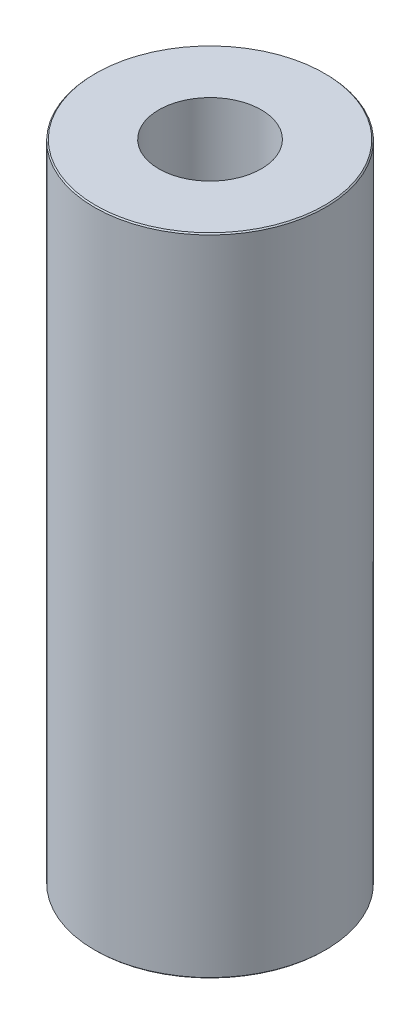
ISO-10303-21;
HEADER;
FILE_DESCRIPTION(('STEP AP214'),'2;1');
FILE_NAME('part.step','',(''),(''),'','','');
FILE_SCHEMA(('AUTOMOTIVE_DESIGN { 1 0 10303 214 1 1 1 1 }'));
ENDSEC;
DATA;
#1=APPLICATION_CONTEXT('core data for automotive mechanical design processes');
#2=APPLICATION_PROTOCOL_DEFINITION('international standard','automotive_design',2000,#1);
#3=PRODUCT_CONTEXT('',#1,'mechanical');
#4=PRODUCT('Part','Part','',(#3));
#5=PRODUCT_RELATED_PRODUCT_CATEGORY('part','',(#4));
#6=PRODUCT_DEFINITION_FORMATION('','',#4);
#7=PRODUCT_DEFINITION_CONTEXT('part definition',#1,'design');
#8=PRODUCT_DEFINITION('design','',#6,#7);
#9=PRODUCT_DEFINITION_SHAPE('','',#8);
#10=(LENGTH_UNIT() NAMED_UNIT(*) SI_UNIT(.MILLI.,.METRE.));
#11=(NAMED_UNIT(*) PLANE_ANGLE_UNIT() SI_UNIT($,.RADIAN.));
#12=(NAMED_UNIT(*) SI_UNIT($,.STERADIAN.) SOLID_ANGLE_UNIT());
#13=UNCERTAINTY_MEASURE_WITH_UNIT(LENGTH_MEASURE(1.E-05),#10,'distance_accuracy_value','');
#14=(GEOMETRIC_REPRESENTATION_CONTEXT(3) GLOBAL_UNCERTAINTY_ASSIGNED_CONTEXT((#13)) GLOBAL_UNIT_ASSIGNED_CONTEXT((#10,
#11,#12)) REPRESENTATION_CONTEXT('',''));
#15=CARTESIAN_POINT('',(0.,0.,0.));
#16=DIRECTION('',(0.,0.,1.));
#17=DIRECTION('',(1.,0.,0.));
#18=AXIS2_PLACEMENT_3D('',#15,#16,#17);
#19=CARTESIAN_POINT('',(0.,265.290275822531,0.));
#20=DIRECTION('',(0.,-1.,0.));
#21=DIRECTION('',(0.,0.,-1.));
#22=AXIS2_PLACEMENT_3D('',#19,#20,#21);
#23=CYLINDRICAL_SURFACE('',#22,47.5);
#24=CARTESIAN_POINT('',(0.,264.812088768207,0.));
#25=DIRECTION('',(0.,1.,0.));
#26=DIRECTION('',(0.,0.,1.));
#27=AXIS2_PLACEMENT_3D('',#24,#25,#26);
#28=CIRCLE('',#27,47.5);
#29=CARTESIAN_POINT('',(0.,264.812088768207,47.5));
#30=VERTEX_POINT('',#29);
#31=EDGE_CURVE('E50',#30,#30,#28,.F.);
#32=ORIENTED_EDGE('',*,*,#31,.T.);
#33=EDGE_LOOP('',(#32));
#34=FACE_BOUND('',#33,.T.);
#35=CARTESIAN_POINT('',(0.,0.478187054323675,0.));
#36=DIRECTION('',(0.,1.,0.));
#37=DIRECTION('',(0.,0.,1.));
#38=AXIS2_PLACEMENT_3D('',#35,#36,#37);
#39=CIRCLE('',#38,47.5);
#40=CARTESIAN_POINT('',(0.,0.478187054323675,47.5));
#41=VERTEX_POINT('',#40);
#42=EDGE_CURVE('E51',#41,#41,#39,.T.);
#43=ORIENTED_EDGE('',*,*,#42,.T.);
#44=EDGE_LOOP('',(#43));
#45=FACE_BOUND('',#44,.T.);
#46=ADVANCED_FACE('F39',(#34,#45),#23,.T.);
#47=CARTESIAN_POINT('',(0.,265.290275822531,0.));
#48=DIRECTION('',(0.,1.,0.));
#49=DIRECTION('',(0.,0.,1.));
#50=AXIS2_PLACEMENT_3D('',#47,#48,#49);
#51=PLANE('',#50);
#52=CARTESIAN_POINT('',(0.,265.290275822531,0.));
#53=DIRECTION('',(0.,1.,0.));
#54=DIRECTION('',(0.,0.,1.));
#55=AXIS2_PLACEMENT_3D('',#52,#53,#54);
#56=CIRCLE('',#55,47.0218129456763);
#57=CARTESIAN_POINT('',(0.,265.290275822531,47.0218129456763));
#58=VERTEX_POINT('',#57);
#59=EDGE_CURVE('E54',#58,#58,#56,.T.);
#60=ORIENTED_EDGE('',*,*,#59,.T.);
#61=EDGE_LOOP('',(#60));
#62=FACE_BOUND('',#61,.T.);
#63=CARTESIAN_POINT('',(0.,265.290275822531,0.));
#64=DIRECTION('',(0.,1.,0.));
#65=DIRECTION('',(0.,0.,1.));
#66=AXIS2_PLACEMENT_3D('',#63,#64,#65);
#67=CIRCLE('',#66,21.0497732973385);
#68=CARTESIAN_POINT('',(0.,265.290275822531,21.0497732973385));
#69=VERTEX_POINT('',#68);
#70=EDGE_CURVE('E58',#69,#69,#67,.T.);
#71=ORIENTED_EDGE('',*,*,#70,.F.);
#72=EDGE_LOOP('',(#71));
#73=FACE_BOUND('',#72,.T.);
#74=ADVANCED_FACE('F69',(#62,#73),#51,.T.);
#75=CARTESIAN_POINT('',(0.,0.,0.));
#76=DIRECTION('',(0.,1.,0.));
#77=DIRECTION('',(0.,0.,1.));
#78=AXIS2_PLACEMENT_3D('',#75,#76,#77);
#79=PLANE('',#78);
#80=CARTESIAN_POINT('',(0.,0.,0.));
#81=DIRECTION('',(0.,1.,0.));
#82=DIRECTION('',(0.,0.,1.));
#83=AXIS2_PLACEMENT_3D('',#80,#81,#82);
#84=CIRCLE('',#83,47.0218129456763);
#85=CARTESIAN_POINT('',(0.,0.,47.0218129456763));
#86=VERTEX_POINT('',#85);
#87=EDGE_CURVE('E10',#86,#86,#84,.F.);
#88=ORIENTED_EDGE('',*,*,#87,.T.);
#89=EDGE_LOOP('',(#88));
#90=FACE_BOUND('',#89,.T.);
#91=CARTESIAN_POINT('',(0.,0.,0.));
#92=DIRECTION('',(0.,1.,0.));
#93=DIRECTION('',(0.,0.,1.));
#94=AXIS2_PLACEMENT_3D('',#91,#92,#93);
#95=CIRCLE('',#94,21.0497732973385);
#96=CARTESIAN_POINT('',(0.,0.,21.0497732973385));
#97=VERTEX_POINT('',#96);
#98=EDGE_CURVE('E63',#97,#97,#95,.T.);
#99=ORIENTED_EDGE('',*,*,#98,.T.);
#100=EDGE_LOOP('',(#99));
#101=FACE_BOUND('',#100,.T.);
#102=ADVANCED_FACE('F75',(#90,#101),#79,.F.);
#103=CARTESIAN_POINT('',(0.,265.290275822531,0.));
#104=DIRECTION('',(0.,-1.,0.));
#105=DIRECTION('',(0.,0.,-1.));
#106=AXIS2_PLACEMENT_3D('',#103,#104,#105);
#107=CYLINDRICAL_SURFACE('',#106,21.0497732973385);
#108=ORIENTED_EDGE('',*,*,#70,.T.);
#109=EDGE_LOOP('',(#108));
#110=FACE_BOUND('',#109,.T.);
#111=ORIENTED_EDGE('',*,*,#98,.F.);
#112=EDGE_LOOP('',(#111));
#113=FACE_BOUND('',#112,.T.);
#114=ADVANCED_FACE('F70',(#110,#113),#107,.F.);
#115=CARTESIAN_POINT('',(0.,265.290275822531,0.));
#116=DIRECTION('',(0.,-1.,0.));
#117=DIRECTION('',(0.,0.,-1.));
#118=AXIS2_PLACEMENT_3D('',#115,#116,#117);
#119=CONICAL_SURFACE('',#118,47.0218129456763,0.785398163397477);
#120=ORIENTED_EDGE('',*,*,#31,.F.);
#121=EDGE_LOOP('',(#120));
#122=FACE_BOUND('',#121,.T.);
#123=ORIENTED_EDGE('',*,*,#59,.F.);
#124=EDGE_LOOP('',(#123));
#125=FACE_BOUND('',#124,.T.);
#126=ADVANCED_FACE('F81',(#122,#125),#119,.T.);
#127=CARTESIAN_POINT('',(0.,0.478187054323675,0.));
#128=DIRECTION('',(0.,1.,0.));
#129=DIRECTION('',(0.,0.,1.));
#130=AXIS2_PLACEMENT_3D('',#127,#128,#129);
#131=CONICAL_SURFACE('',#130,47.5,0.785398163397441);
#132=ORIENTED_EDGE('',*,*,#87,.F.);
#133=EDGE_LOOP('',(#132));
#134=FACE_BOUND('',#133,.T.);
#135=ORIENTED_EDGE('',*,*,#42,.F.);
#136=EDGE_LOOP('',(#135));
#137=FACE_BOUND('',#136,.T.);
#138=ADVANCED_FACE('F45',(#134,#137),#131,.T.);
#139=CLOSED_SHELL('',(#46,#74,#102,#114,#126,#138));
#140=MANIFOLD_SOLID_BREP('B2',#139);
#141=ADVANCED_BREP_SHAPE_REPRESENTATION('',(#18,#140),#14);
#142=SHAPE_DEFINITION_REPRESENTATION(#9,#141);
ENDSEC;
END-ISO-10303-21;
